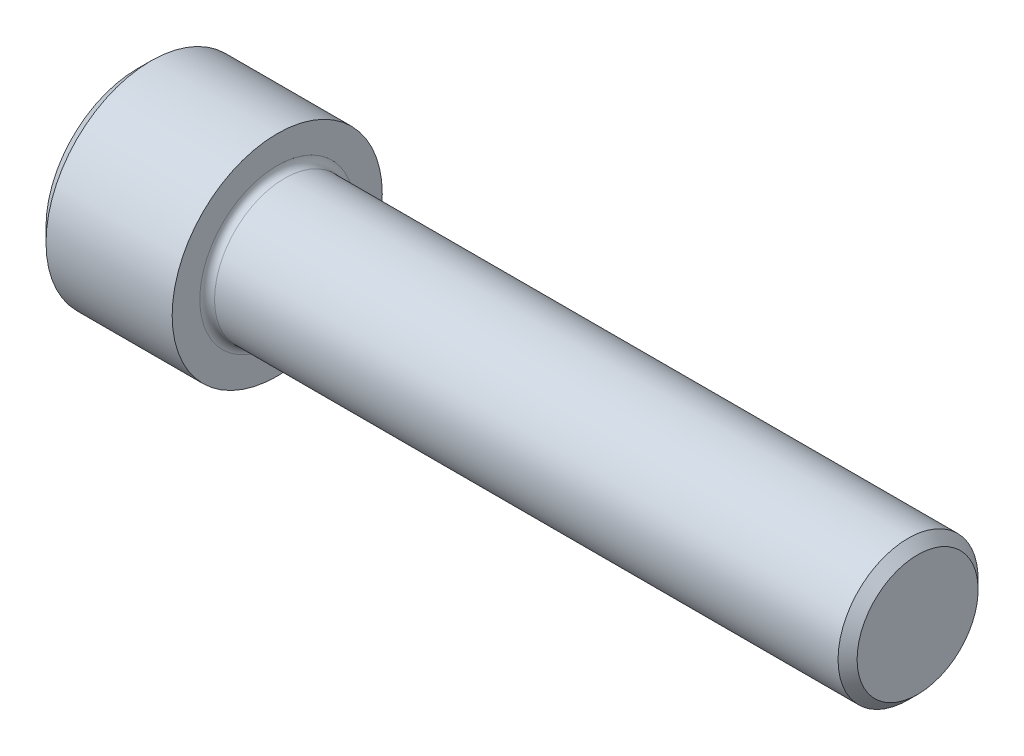
ISO-10303-21;
HEADER;
FILE_DESCRIPTION(('STEP AP214'),'2;1');
FILE_NAME('part.step','',(''),(''),'','','');
FILE_SCHEMA(('AUTOMOTIVE_DESIGN { 1 0 10303 214 1 1 1 1 }'));
ENDSEC;
DATA;
#1=APPLICATION_CONTEXT('core data for automotive mechanical design processes');
#2=APPLICATION_PROTOCOL_DEFINITION('international standard','automotive_design',2000,#1);
#3=PRODUCT_CONTEXT('',#1,'mechanical');
#4=PRODUCT('Part','Part','',(#3));
#5=PRODUCT_RELATED_PRODUCT_CATEGORY('part','',(#4));
#6=PRODUCT_DEFINITION_FORMATION('','',#4);
#7=PRODUCT_DEFINITION_CONTEXT('part definition',#1,'design');
#8=PRODUCT_DEFINITION('design','',#6,#7);
#9=PRODUCT_DEFINITION_SHAPE('','',#8);
#10=(LENGTH_UNIT() NAMED_UNIT(*) SI_UNIT(.MILLI.,.METRE.));
#11=(NAMED_UNIT(*) PLANE_ANGLE_UNIT() SI_UNIT($,.RADIAN.));
#12=(NAMED_UNIT(*) SI_UNIT($,.STERADIAN.) SOLID_ANGLE_UNIT());
#13=UNCERTAINTY_MEASURE_WITH_UNIT(LENGTH_MEASURE(1.E-05),#10,'distance_accuracy_value','');
#14=(GEOMETRIC_REPRESENTATION_CONTEXT(3) GLOBAL_UNCERTAINTY_ASSIGNED_CONTEXT((#13)) GLOBAL_UNIT_ASSIGNED_CONTEXT((#10,
#11,#12)) REPRESENTATION_CONTEXT('',''));
#15=CARTESIAN_POINT('',(0.,0.,0.));
#16=DIRECTION('',(0.,0.,1.));
#17=DIRECTION('',(1.,0.,0.));
#18=AXIS2_PLACEMENT_3D('',#15,#16,#17);
#19=CARTESIAN_POINT('',(0.,0.,0.));
#20=DIRECTION('',(-1.,0.,0.));
#21=DIRECTION('',(0.,0.,1.));
#22=AXIS2_PLACEMENT_3D('',#19,#20,#21);
#23=PLANE('',#22);
#24=DIRECTION('',(0.,-0.499999999999998,0.86602540378444));
#25=VECTOR('',#24,1.);
#26=CARTESIAN_POINT('',(0.,5.49926131403118,0.));
#27=LINE('',#26,#25);
#28=CARTESIAN_POINT('',(0.,5.49926131403118,0.));
#29=VERTEX_POINT('',#28);
#30=CARTESIAN_POINT('',(0.,2.7496306570156,4.7625));
#31=VERTEX_POINT('',#30);
#32=EDGE_CURVE('E262',#29,#31,#27,.T.);
#33=ORIENTED_EDGE('',*,*,#32,.T.);
#34=DIRECTION('',(0.,1.,0.));
#35=VECTOR('',#34,1.);
#36=CARTESIAN_POINT('',(0.,-2.74963065701558,4.7625));
#37=LINE('',#36,#35);
#38=CARTESIAN_POINT('',(0.,-2.74963065701558,4.7625));
#39=VERTEX_POINT('',#38);
#40=EDGE_CURVE('E133',#39,#31,#37,.T.);
#41=ORIENTED_EDGE('',*,*,#40,.F.);
#42=DIRECTION('',(0.,-0.500000000000001,-0.866025403784438));
#43=VECTOR('',#42,1.);
#44=CARTESIAN_POINT('',(0.,-2.74963065701558,4.7625));
#45=LINE('',#44,#43);
#46=CARTESIAN_POINT('',(0.,-5.49926131403118,0.));
#47=VERTEX_POINT('',#46);
#48=EDGE_CURVE('E265',#39,#47,#45,.T.);
#49=ORIENTED_EDGE('',*,*,#48,.T.);
#50=DIRECTION('',(0.,0.499999999999998,-0.86602540378444));
#51=VECTOR('',#50,1.);
#52=CARTESIAN_POINT('',(0.,-5.49926131403118,0.));
#53=LINE('',#52,#51);
#54=CARTESIAN_POINT('',(0.,-2.7496306570156,-4.7625));
#55=VERTEX_POINT('',#54);
#56=EDGE_CURVE('E268',#47,#55,#53,.T.);
#57=ORIENTED_EDGE('',*,*,#56,.T.);
#58=DIRECTION('',(0.,-1.,0.));
#59=VECTOR('',#58,1.);
#60=CARTESIAN_POINT('',(0.,2.74963065701558,-4.7625));
#61=LINE('',#60,#59);
#62=CARTESIAN_POINT('',(0.,2.74963065701558,-4.7625));
#63=VERTEX_POINT('',#62);
#64=EDGE_CURVE('E271',#63,#55,#61,.T.);
#65=ORIENTED_EDGE('',*,*,#64,.F.);
#66=DIRECTION('',(0.,-0.500000000000001,-0.866025403784438));
#67=VECTOR('',#66,1.);
#68=CARTESIAN_POINT('',(0.,5.49926131403118,0.));
#69=LINE('',#68,#67);
#70=EDGE_CURVE('E128',#29,#63,#69,.T.);
#71=ORIENTED_EDGE('',*,*,#70,.F.);
#72=EDGE_LOOP('',(#33,#41,#49,#57,#65,#71));
#73=FACE_BOUND('',#72,.T.);
#74=CARTESIAN_POINT('',(0.,0.,0.));
#75=DIRECTION('',(-1.,0.,0.));
#76=DIRECTION('',(0.,0.,1.));
#77=AXIS2_PLACEMENT_3D('',#74,#75,#76);
#78=CIRCLE('',#77,7.23011);
#79=CARTESIAN_POINT('',(0.,0.,7.23011));
#80=VERTEX_POINT('',#79);
#81=EDGE_CURVE('E157',#80,#80,#78,.T.);
#82=ORIENTED_EDGE('',*,*,#81,.T.);
#83=EDGE_LOOP('',(#82));
#84=FACE_BOUND('',#83,.T.);
#85=ADVANCED_FACE('F37',(#73,#84),#23,.T.);
#86=CARTESIAN_POINT('',(0.,0.,0.));
#87=DIRECTION('',(1.,0.,0.));
#88=DIRECTION('',(0.,0.,-1.));
#89=AXIS2_PLACEMENT_3D('',#86,#87,#88);
#90=CONICAL_SURFACE('',#89,7.23011,0.785398163397448);
#91=CARTESIAN_POINT('',(1.1049,0.,0.));
#92=DIRECTION('',(-1.,0.,0.));
#93=DIRECTION('',(0.,0.,1.));
#94=AXIS2_PLACEMENT_3D('',#91,#92,#93);
#95=CIRCLE('',#94,8.33501);
#96=CARTESIAN_POINT('',(1.1049,0.,8.33501));
#97=VERTEX_POINT('',#96);
#98=EDGE_CURVE('E154',#97,#97,#95,.T.);
#99=ORIENTED_EDGE('',*,*,#98,.T.);
#100=EDGE_LOOP('',(#99));
#101=FACE_BOUND('',#100,.T.);
#102=ORIENTED_EDGE('',*,*,#81,.F.);
#103=EDGE_LOOP('',(#102));
#104=FACE_BOUND('',#103,.T.);
#105=ADVANCED_FACE('F178',(#101,#104),#90,.T.);
#106=CARTESIAN_POINT('',(-31.75,0.,0.));
#107=DIRECTION('',(-1.,0.,0.));
#108=DIRECTION('',(0.,0.,1.));
#109=AXIS2_PLACEMENT_3D('',#106,#107,#108);
#110=CYLINDRICAL_SURFACE('',#109,8.33501);
#111=CARTESIAN_POINT('',(11.1125,0.,0.));
#112=DIRECTION('',(-1.,0.,0.));
#113=DIRECTION('',(0.,0.,1.));
#114=AXIS2_PLACEMENT_3D('',#111,#112,#113);
#115=CIRCLE('',#114,8.33501);
#116=CARTESIAN_POINT('',(11.1125,0.,8.33501));
#117=VERTEX_POINT('',#116);
#118=EDGE_CURVE('E151',#117,#117,#115,.T.);
#119=ORIENTED_EDGE('',*,*,#118,.T.);
#120=EDGE_LOOP('',(#119));
#121=FACE_BOUND('',#120,.T.);
#122=ORIENTED_EDGE('',*,*,#98,.F.);
#123=EDGE_LOOP('',(#122));
#124=FACE_BOUND('',#123,.T.);
#125=ADVANCED_FACE('F183',(#121,#124),#110,.T.);
#126=CARTESIAN_POINT('',(11.1125,8.33501,0.));
#127=DIRECTION('',(1.,0.,0.));
#128=DIRECTION('',(0.,0.,-1.));
#129=AXIS2_PLACEMENT_3D('',#126,#127,#128);
#130=PLANE('',#129);
#131=CARTESIAN_POINT('',(11.1125,0.,0.));
#132=DIRECTION('',(1.,0.,0.));
#133=DIRECTION('',(0.,0.,-1.));
#134=AXIS2_PLACEMENT_3D('',#131,#132,#133);
#135=CIRCLE('',#134,6.14045);
#136=CARTESIAN_POINT('',(11.1125,0.,-6.14045));
#137=VERTEX_POINT('',#136);
#138=EDGE_CURVE('E45',#137,#137,#135,.F.);
#139=ORIENTED_EDGE('',*,*,#138,.T.);
#140=EDGE_LOOP('',(#139));
#141=FACE_BOUND('',#140,.T.);
#142=ORIENTED_EDGE('',*,*,#118,.F.);
#143=EDGE_LOOP('',(#142));
#144=FACE_BOUND('',#143,.T.);
#145=ADVANCED_FACE('F162',(#141,#144),#130,.T.);
#146=CARTESIAN_POINT('',(-31.75,0.,0.));
#147=DIRECTION('',(-1.,0.,0.));
#148=DIRECTION('',(0.,0.,1.));
#149=AXIS2_PLACEMENT_3D('',#146,#147,#148);
#150=CYLINDRICAL_SURFACE('',#149,5.55625);
#151=CARTESIAN_POINT('',(11.6967,0.,0.));
#152=DIRECTION('',(1.,0.,0.));
#153=DIRECTION('',(0.,0.,-1.));
#154=AXIS2_PLACEMENT_3D('',#151,#152,#153);
#155=CIRCLE('',#154,5.55625);
#156=CARTESIAN_POINT('',(11.6967,0.,-5.55625));
#157=VERTEX_POINT('',#156);
#158=EDGE_CURVE('E11',#157,#157,#155,.T.);
#159=ORIENTED_EDGE('',*,*,#158,.T.);
#160=EDGE_LOOP('',(#159));
#161=FACE_BOUND('',#160,.T.);
#162=CARTESIAN_POINT('',(61.15685,0.,0.));
#163=DIRECTION('',(-1.,0.,0.));
#164=DIRECTION('',(0.,0.,1.));
#165=AXIS2_PLACEMENT_3D('',#162,#163,#164);
#166=CIRCLE('',#165,5.55625);
#167=CARTESIAN_POINT('',(61.15685,0.,5.55625));
#168=VERTEX_POINT('',#167);
#169=EDGE_CURVE('E148',#168,#168,#166,.T.);
#170=ORIENTED_EDGE('',*,*,#169,.T.);
#171=EDGE_LOOP('',(#170));
#172=FACE_BOUND('',#171,.T.);
#173=ADVANCED_FACE('F193',(#161,#172),#150,.T.);
#174=CARTESIAN_POINT('',(61.9125,0.,0.));
#175=DIRECTION('',(-1.,0.,0.));
#176=DIRECTION('',(0.,0.,1.));
#177=AXIS2_PLACEMENT_3D('',#174,#175,#176);
#178=CONICAL_SURFACE('',#177,4.8006,0.78539816339747);
#179=ORIENTED_EDGE('',*,*,#169,.F.);
#180=EDGE_LOOP('',(#179));
#181=FACE_BOUND('',#180,.T.);
#182=CARTESIAN_POINT('',(61.9125,0.,0.));
#183=DIRECTION('',(-1.,0.,0.));
#184=DIRECTION('',(0.,0.,1.));
#185=AXIS2_PLACEMENT_3D('',#182,#183,#184);
#186=CIRCLE('',#185,4.8006);
#187=CARTESIAN_POINT('',(61.9125,0.,4.8006));
#188=VERTEX_POINT('',#187);
#189=EDGE_CURVE('E144',#188,#188,#186,.T.);
#190=ORIENTED_EDGE('',*,*,#189,.T.);
#191=EDGE_LOOP('',(#190));
#192=FACE_BOUND('',#191,.T.);
#193=ADVANCED_FACE('F173',(#181,#192),#178,.T.);
#194=CARTESIAN_POINT('',(61.9125,4.8006,0.));
#195=DIRECTION('',(1.,0.,0.));
#196=DIRECTION('',(0.,0.,-1.));
#197=AXIS2_PLACEMENT_3D('',#194,#195,#196);
#198=PLANE('',#197);
#199=ORIENTED_EDGE('',*,*,#189,.F.);
#200=EDGE_LOOP('',(#199));
#201=FACE_BOUND('',#200,.T.);
#202=ADVANCED_FACE('F166',(#201),#198,.T.);
#203=CARTESIAN_POINT('',(11.6967,0.,0.));
#204=DIRECTION('',(1.,0.,0.));
#205=DIRECTION('',(0.,0.,-1.));
#206=AXIS2_PLACEMENT_3D('',#203,#204,#205);
#207=TOROIDAL_SURFACE('',#206,6.14045,0.5842);
#208=ORIENTED_EDGE('',*,*,#158,.F.);
#209=EDGE_LOOP('',(#208));
#210=FACE_BOUND('',#209,.T.);
#211=ORIENTED_EDGE('',*,*,#138,.F.);
#212=EDGE_LOOP('',(#211));
#213=FACE_BOUND('',#212,.T.);
#214=ADVANCED_FACE('F39',(#210,#213),#207,.F.);
#215=CARTESIAN_POINT('',(5.4102,5.49926131403118,0.));
#216=DIRECTION('',(0.,-0.86602540378444,-0.499999999999998));
#217=DIRECTION('',(0.,0.499999999999998,-0.86602540378444));
#218=AXIS2_PLACEMENT_3D('',#215,#216,#217);
#219=PLANE('',#218);
#220=ORIENTED_EDGE('',*,*,#32,.F.);
#221=DIRECTION('',(-1.,0.,0.));
#222=VECTOR('',#221,1.);
#223=CARTESIAN_POINT('',(5.4102,5.49926131403118,0.));
#224=LINE('',#223,#222);
#225=CARTESIAN_POINT('',(5.4102,5.49926131403118,0.));
#226=VERTEX_POINT('',#225);
#227=EDGE_CURVE('E252',#226,#29,#224,.T.);
#228=ORIENTED_EDGE('',*,*,#227,.F.);
#229=DIRECTION('',(0.,-0.499999999999998,0.86602540378444));
#230=VECTOR('',#229,1.);
#231=CARTESIAN_POINT('',(5.4102,5.49926131403118,0.));
#232=LINE('',#231,#230);
#233=CARTESIAN_POINT('',(5.4102,4.1244459855234,2.38124999999999));
#234=VERTEX_POINT('',#233);
#235=EDGE_CURVE('E120',#226,#234,#232,.T.);
#236=ORIENTED_EDGE('',*,*,#235,.T.);
#237=CARTESIAN_POINT('',(5.4102,2.7496306570156,4.7625));
#238=VERTEX_POINT('',#237);
#239=EDGE_CURVE('E111',#234,#238,#232,.T.);
#240=ORIENTED_EDGE('',*,*,#239,.T.);
#241=DIRECTION('',(-1.,0.,0.));
#242=VECTOR('',#241,1.);
#243=CARTESIAN_POINT('',(5.4102,2.7496306570156,4.7625));
#244=LINE('',#243,#242);
#245=EDGE_CURVE('E125',#238,#31,#244,.T.);
#246=ORIENTED_EDGE('',*,*,#245,.T.);
#247=EDGE_LOOP('',(#220,#228,#236,#240,#246));
#248=FACE_BOUND('',#247,.T.);
#249=ADVANCED_FACE('F124',(#248),#219,.T.);
#250=CARTESIAN_POINT('',(5.4102,-2.74963065701558,4.7625));
#251=DIRECTION('',(0.,0.,1.));
#252=DIRECTION('',(0.,-1.,0.));
#253=AXIS2_PLACEMENT_3D('',#250,#251,#252);
#254=PLANE('',#253);
#255=ORIENTED_EDGE('',*,*,#40,.T.);
#256=ORIENTED_EDGE('',*,*,#245,.F.);
#257=DIRECTION('',(0.,1.,0.));
#258=VECTOR('',#257,1.);
#259=CARTESIAN_POINT('',(5.4102,-2.74963065701558,4.7625));
#260=LINE('',#259,#258);
#261=CARTESIAN_POINT('',(5.4102,0.,4.7625));
#262=VERTEX_POINT('',#261);
#263=EDGE_CURVE('E108',#262,#238,#260,.T.);
#264=ORIENTED_EDGE('',*,*,#263,.F.);
#265=CARTESIAN_POINT('',(5.4102,-2.74963065701558,4.7625));
#266=VERTEX_POINT('',#265);
#267=EDGE_CURVE('E119',#266,#262,#260,.T.);
#268=ORIENTED_EDGE('',*,*,#267,.F.);
#269=DIRECTION('',(-1.,0.,0.));
#270=VECTOR('',#269,1.);
#271=CARTESIAN_POINT('',(5.4102,-2.74963065701558,4.7625));
#272=LINE('',#271,#270);
#273=EDGE_CURVE('E135',#266,#39,#272,.T.);
#274=ORIENTED_EDGE('',*,*,#273,.T.);
#275=EDGE_LOOP('',(#255,#256,#264,#268,#274));
#276=FACE_BOUND('',#275,.T.);
#277=ADVANCED_FACE('F130',(#276),#254,.F.);
#278=CARTESIAN_POINT('',(5.4102,-2.74963065701558,4.7625));
#279=DIRECTION('',(0.,0.866025403784438,-0.500000000000001));
#280=DIRECTION('',(0.,0.500000000000001,0.866025403784438));
#281=AXIS2_PLACEMENT_3D('',#278,#279,#280);
#282=PLANE('',#281);
#283=ORIENTED_EDGE('',*,*,#48,.F.);
#284=ORIENTED_EDGE('',*,*,#273,.F.);
#285=DIRECTION('',(0.,-0.500000000000001,-0.866025403784438));
#286=VECTOR('',#285,1.);
#287=CARTESIAN_POINT('',(5.4102,-2.74963065701558,4.7625));
#288=LINE('',#287,#286);
#289=CARTESIAN_POINT('',(5.4102,-4.12444598552338,2.38125));
#290=VERTEX_POINT('',#289);
#291=EDGE_CURVE('E291',#266,#290,#288,.T.);
#292=ORIENTED_EDGE('',*,*,#291,.T.);
#293=CARTESIAN_POINT('',(5.4102,-5.49926131403118,0.));
#294=VERTEX_POINT('',#293);
#295=EDGE_CURVE('E280',#290,#294,#288,.T.);
#296=ORIENTED_EDGE('',*,*,#295,.T.);
#297=DIRECTION('',(-1.,0.,0.));
#298=VECTOR('',#297,1.);
#299=CARTESIAN_POINT('',(5.4102,-5.49926131403118,0.));
#300=LINE('',#299,#298);
#301=EDGE_CURVE('E140',#294,#47,#300,.T.);
#302=ORIENTED_EDGE('',*,*,#301,.T.);
#303=EDGE_LOOP('',(#283,#284,#292,#296,#302));
#304=FACE_BOUND('',#303,.T.);
#305=ADVANCED_FACE('F206',(#304),#282,.T.);
#306=CARTESIAN_POINT('',(5.4102,-5.49926131403118,0.));
#307=DIRECTION('',(0.,0.86602540378444,0.499999999999998));
#308=DIRECTION('',(0.,-0.499999999999998,0.86602540378444));
#309=AXIS2_PLACEMENT_3D('',#306,#307,#308);
#310=PLANE('',#309);
#311=ORIENTED_EDGE('',*,*,#56,.F.);
#312=ORIENTED_EDGE('',*,*,#301,.F.);
#313=DIRECTION('',(0.,0.499999999999998,-0.86602540378444));
#314=VECTOR('',#313,1.);
#315=CARTESIAN_POINT('',(5.4102,-5.49926131403118,0.));
#316=LINE('',#315,#314);
#317=CARTESIAN_POINT('',(5.4102,-4.1244459855234,-2.38124999999999));
#318=VERTEX_POINT('',#317);
#319=EDGE_CURVE('E258',#294,#318,#316,.T.);
#320=ORIENTED_EDGE('',*,*,#319,.T.);
#321=CARTESIAN_POINT('',(5.4102,-2.7496306570156,-4.7625));
#322=VERTEX_POINT('',#321);
#323=EDGE_CURVE('E290',#318,#322,#316,.T.);
#324=ORIENTED_EDGE('',*,*,#323,.T.);
#325=DIRECTION('',(-1.,0.,0.));
#326=VECTOR('',#325,1.);
#327=CARTESIAN_POINT('',(5.4102,-2.7496306570156,-4.7625));
#328=LINE('',#327,#326);
#329=EDGE_CURVE('E251',#322,#55,#328,.T.);
#330=ORIENTED_EDGE('',*,*,#329,.T.);
#331=EDGE_LOOP('',(#311,#312,#320,#324,#330));
#332=FACE_BOUND('',#331,.T.);
#333=ADVANCED_FACE('F209',(#332),#310,.T.);
#334=CARTESIAN_POINT('',(5.4102,2.74963065701558,-4.7625));
#335=DIRECTION('',(0.,0.,-1.));
#336=DIRECTION('',(0.,1.,0.));
#337=AXIS2_PLACEMENT_3D('',#334,#335,#336);
#338=PLANE('',#337);
#339=ORIENTED_EDGE('',*,*,#64,.T.);
#340=ORIENTED_EDGE('',*,*,#329,.F.);
#341=DIRECTION('',(0.,-1.,0.));
#342=VECTOR('',#341,1.);
#343=CARTESIAN_POINT('',(5.4102,2.74963065701558,-4.7625));
#344=LINE('',#343,#342);
#345=CARTESIAN_POINT('',(5.4102,0.,-4.7625));
#346=VERTEX_POINT('',#345);
#347=EDGE_CURVE('E255',#346,#322,#344,.T.);
#348=ORIENTED_EDGE('',*,*,#347,.F.);
#349=CARTESIAN_POINT('',(5.4102,2.74963065701558,-4.7625));
#350=VERTEX_POINT('',#349);
#351=EDGE_CURVE('E52',#350,#346,#344,.T.);
#352=ORIENTED_EDGE('',*,*,#351,.F.);
#353=DIRECTION('',(-1.,0.,0.));
#354=VECTOR('',#353,1.);
#355=CARTESIAN_POINT('',(5.4102,2.74963065701558,-4.7625));
#356=LINE('',#355,#354);
#357=EDGE_CURVE('E248',#350,#63,#356,.T.);
#358=ORIENTED_EDGE('',*,*,#357,.T.);
#359=EDGE_LOOP('',(#339,#340,#348,#352,#358));
#360=FACE_BOUND('',#359,.T.);
#361=ADVANCED_FACE('F213',(#360),#338,.F.);
#362=CARTESIAN_POINT('',(5.4102,5.49926131403118,0.));
#363=DIRECTION('',(0.,0.866025403784438,-0.500000000000001));
#364=DIRECTION('',(0.,0.500000000000001,0.866025403784438));
#365=AXIS2_PLACEMENT_3D('',#362,#363,#364);
#366=PLANE('',#365);
#367=ORIENTED_EDGE('',*,*,#70,.T.);
#368=ORIENTED_EDGE('',*,*,#357,.F.);
#369=DIRECTION('',(0.,-0.500000000000001,-0.866025403784438));
#370=VECTOR('',#369,1.);
#371=CARTESIAN_POINT('',(5.4102,5.49926131403118,0.));
#372=LINE('',#371,#370);
#373=CARTESIAN_POINT('',(5.4102,4.12444598552339,-2.38125000000001));
#374=VERTEX_POINT('',#373);
#375=EDGE_CURVE('E238',#374,#350,#372,.T.);
#376=ORIENTED_EDGE('',*,*,#375,.F.);
#377=EDGE_CURVE('E244',#226,#374,#372,.T.);
#378=ORIENTED_EDGE('',*,*,#377,.F.);
#379=ORIENTED_EDGE('',*,*,#227,.T.);
#380=EDGE_LOOP('',(#367,#368,#376,#378,#379));
#381=FACE_BOUND('',#380,.T.);
#382=ADVANCED_FACE('F217',(#381),#366,.F.);
#383=CARTESIAN_POINT('',(5.4102,8.24889197104677,-4.76250000000001));
#384=DIRECTION('',(1.,0.,0.));
#385=DIRECTION('',(0.,0.,-1.));
#386=AXIS2_PLACEMENT_3D('',#383,#384,#385);
#387=PLANE('',#386);
#388=ORIENTED_EDGE('',*,*,#347,.T.);
#389=ORIENTED_EDGE('',*,*,#323,.F.);
#390=CARTESIAN_POINT('',(5.4102,0.,0.));
#391=DIRECTION('',(-1.,0.,0.));
#392=DIRECTION('',(0.,0.,1.));
#393=AXIS2_PLACEMENT_3D('',#390,#391,#392);
#394=CIRCLE('',#393,4.7625);
#395=EDGE_CURVE('E286',#346,#318,#394,.T.);
#396=ORIENTED_EDGE('',*,*,#395,.F.);
#397=EDGE_LOOP('',(#388,#389,#396));
#398=FACE_BOUND('',#397,.T.);
#399=ADVANCED_FACE('F221',(#398),#387,.F.);
#400=ORIENTED_EDGE('',*,*,#319,.F.);
#401=ORIENTED_EDGE('',*,*,#295,.F.);
#402=EDGE_CURVE('E138',#318,#290,#394,.T.);
#403=ORIENTED_EDGE('',*,*,#402,.F.);
#404=EDGE_LOOP('',(#400,#401,#403));
#405=FACE_BOUND('',#404,.T.);
#406=ADVANCED_FACE('F224',(#405),#387,.F.);
#407=ORIENTED_EDGE('',*,*,#291,.F.);
#408=ORIENTED_EDGE('',*,*,#267,.T.);
#409=EDGE_CURVE('E134',#290,#262,#394,.T.);
#410=ORIENTED_EDGE('',*,*,#409,.F.);
#411=EDGE_LOOP('',(#407,#408,#410));
#412=FACE_BOUND('',#411,.T.);
#413=ADVANCED_FACE('F229',(#412),#387,.F.);
#414=ORIENTED_EDGE('',*,*,#263,.T.);
#415=ORIENTED_EDGE('',*,*,#239,.F.);
#416=EDGE_CURVE('E114',#262,#234,#394,.T.);
#417=ORIENTED_EDGE('',*,*,#416,.F.);
#418=EDGE_LOOP('',(#414,#415,#417));
#419=FACE_BOUND('',#418,.T.);
#420=ADVANCED_FACE('F110',(#419),#387,.F.);
#421=ORIENTED_EDGE('',*,*,#235,.F.);
#422=ORIENTED_EDGE('',*,*,#377,.T.);
#423=EDGE_CURVE('E145',#234,#374,#394,.T.);
#424=ORIENTED_EDGE('',*,*,#423,.F.);
#425=EDGE_LOOP('',(#421,#422,#424));
#426=FACE_BOUND('',#425,.T.);
#427=ADVANCED_FACE('F232',(#426),#387,.F.);
#428=ORIENTED_EDGE('',*,*,#375,.T.);
#429=ORIENTED_EDGE('',*,*,#351,.T.);
#430=EDGE_CURVE('E241',#374,#346,#394,.T.);
#431=ORIENTED_EDGE('',*,*,#430,.F.);
#432=EDGE_LOOP('',(#428,#429,#431));
#433=FACE_BOUND('',#432,.T.);
#434=ADVANCED_FACE('F202',(#433),#387,.F.);
#435=CARTESIAN_POINT('',(5.4102,0.,0.));
#436=DIRECTION('',(-1.,0.,0.));
#437=DIRECTION('',(0.,0.,1.));
#438=AXIS2_PLACEMENT_3D('',#435,#436,#437);
#439=CONICAL_SURFACE('',#438,4.7625,1.04719755119659);
#440=CARTESIAN_POINT('',(8.15983065701563,0.,0.));
#441=VERTEX_POINT('',#440);
#442=VERTEX_LOOP('',#441);
#443=FACE_BOUND('',#442,.T.);
#444=ORIENTED_EDGE('',*,*,#416,.T.);
#445=ORIENTED_EDGE('',*,*,#423,.T.);
#446=ORIENTED_EDGE('',*,*,#430,.T.);
#447=ORIENTED_EDGE('',*,*,#395,.T.);
#448=ORIENTED_EDGE('',*,*,#402,.T.);
#449=ORIENTED_EDGE('',*,*,#409,.T.);
#450=EDGE_LOOP('',(#444,#445,#446,#447,#448,#449));
#451=FACE_BOUND('',#450,.T.);
#452=ADVANCED_FACE('F200',(#443,#451),#439,.F.);
#453=CLOSED_SHELL('',(#85,#105,#125,#145,#173,#193,#202,#214,#249,#277,#305,#333,#361,#382,#399,
#406,#413,#420,#427,#434,#452));
#454=MANIFOLD_SOLID_BREP('B2',#453);
#455=ADVANCED_BREP_SHAPE_REPRESENTATION('',(#18,#454),#14);
#456=SHAPE_DEFINITION_REPRESENTATION(#9,#455);
ENDSEC;
END-ISO-10303-21;
